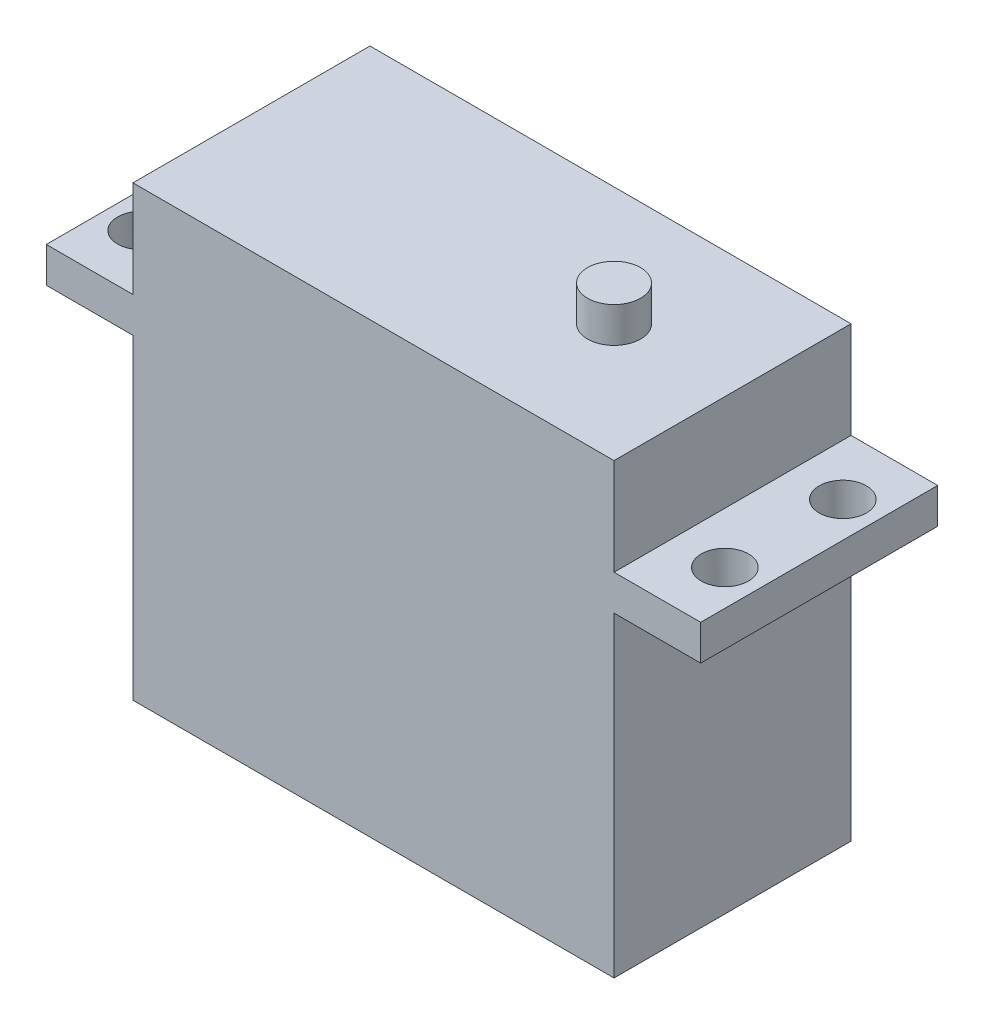
ISO-10303-21;
HEADER;
FILE_DESCRIPTION(('STEP AP214'),'2;1');
FILE_NAME('part.step','',(''),(''),'','','');
FILE_SCHEMA(('AUTOMOTIVE_DESIGN { 1 0 10303 214 1 1 1 1 }'));
ENDSEC;
DATA;
#1=APPLICATION_CONTEXT('core data for automotive mechanical design processes');
#2=APPLICATION_PROTOCOL_DEFINITION('international standard','automotive_design',2000,#1);
#3=PRODUCT_CONTEXT('',#1,'mechanical');
#4=PRODUCT('Part','Part','',(#3));
#5=PRODUCT_RELATED_PRODUCT_CATEGORY('part','',(#4));
#6=PRODUCT_DEFINITION_FORMATION('','',#4);
#7=PRODUCT_DEFINITION_CONTEXT('part definition',#1,'design');
#8=PRODUCT_DEFINITION('design','',#6,#7);
#9=PRODUCT_DEFINITION_SHAPE('','',#8);
#10=(LENGTH_UNIT() NAMED_UNIT(*) SI_UNIT(.MILLI.,.METRE.));
#11=(NAMED_UNIT(*) PLANE_ANGLE_UNIT() SI_UNIT($,.RADIAN.));
#12=(NAMED_UNIT(*) SI_UNIT($,.STERADIAN.) SOLID_ANGLE_UNIT());
#13=UNCERTAINTY_MEASURE_WITH_UNIT(LENGTH_MEASURE(1.E-05),#10,'distance_accuracy_value','');
#14=(GEOMETRIC_REPRESENTATION_CONTEXT(3) GLOBAL_UNCERTAINTY_ASSIGNED_CONTEXT((#13)) GLOBAL_UNIT_ASSIGNED_CONTEXT((#10,
#11,#12)) REPRESENTATION_CONTEXT('',''));
#15=CARTESIAN_POINT('',(0.,0.,0.));
#16=DIRECTION('',(0.,0.,1.));
#17=DIRECTION('',(1.,0.,0.));
#18=AXIS2_PLACEMENT_3D('',#15,#16,#17);
#19=CARTESIAN_POINT('',(0.,0.,20.1));
#20=DIRECTION('',(1.,0.,0.));
#21=DIRECTION('',(0.,0.,-1.));
#22=AXIS2_PLACEMENT_3D('',#19,#20,#21);
#23=PLANE('',#22);
#24=DIRECTION('',(0.,-1.,0.));
#25=VECTOR('',#24,1.);
#26=CARTESIAN_POINT('',(0.,0.,20.1));
#27=LINE('',#26,#25);
#28=CARTESIAN_POINT('',(0.,26.8,20.1));
#29=VERTEX_POINT('',#28);
#30=CARTESIAN_POINT('',(0.,0.,20.1));
#31=VERTEX_POINT('',#30);
#32=EDGE_CURVE('E169',#29,#31,#27,.T.);
#33=ORIENTED_EDGE('',*,*,#32,.F.);
#34=DIRECTION('',(0.,0.,-1.));
#35=VECTOR('',#34,1.);
#36=CARTESIAN_POINT('',(0.,26.8,20.1));
#37=LINE('',#36,#35);
#38=CARTESIAN_POINT('',(0.,26.8,0.));
#39=VERTEX_POINT('',#38);
#40=EDGE_CURVE('E161',#29,#39,#37,.T.);
#41=ORIENTED_EDGE('',*,*,#40,.T.);
#42=DIRECTION('',(0.,-1.,0.));
#43=VECTOR('',#42,1.);
#44=CARTESIAN_POINT('',(0.,0.,0.));
#45=LINE('',#44,#43);
#46=CARTESIAN_POINT('',(0.,0.,0.));
#47=VERTEX_POINT('',#46);
#48=EDGE_CURVE('E164',#39,#47,#45,.T.);
#49=ORIENTED_EDGE('',*,*,#48,.T.);
#50=DIRECTION('',(0.,0.,-1.));
#51=VECTOR('',#50,1.);
#52=CARTESIAN_POINT('',(0.,0.,20.1));
#53=LINE('',#52,#51);
#54=EDGE_CURVE('E44',#31,#47,#53,.T.);
#55=ORIENTED_EDGE('',*,*,#54,.F.);
#56=EDGE_LOOP('',(#33,#41,#49,#55));
#57=FACE_BOUND('',#56,.T.);
#58=ADVANCED_FACE('F36',(#57),#23,.F.);
#59=CARTESIAN_POINT('',(40.8,0.,20.1));
#60=DIRECTION('',(-1.,0.,0.));
#61=DIRECTION('',(0.,0.,1.));
#62=AXIS2_PLACEMENT_3D('',#59,#60,#61);
#63=PLANE('',#62);
#64=DIRECTION('',(0.,1.,0.));
#65=VECTOR('',#64,1.);
#66=CARTESIAN_POINT('',(40.8,0.,0.));
#67=LINE('',#66,#65);
#68=CARTESIAN_POINT('',(40.8,0.,0.));
#69=VERTEX_POINT('',#68);
#70=CARTESIAN_POINT('',(40.8,26.8,0.));
#71=VERTEX_POINT('',#70);
#72=EDGE_CURVE('E184',#69,#71,#67,.T.);
#73=ORIENTED_EDGE('',*,*,#72,.T.);
#74=DIRECTION('',(0.,0.,1.));
#75=VECTOR('',#74,1.);
#76=CARTESIAN_POINT('',(40.8,26.8,20.1));
#77=LINE('',#76,#75);
#78=CARTESIAN_POINT('',(40.8,26.8,20.1));
#79=VERTEX_POINT('',#78);
#80=EDGE_CURVE('E132',#71,#79,#77,.T.);
#81=ORIENTED_EDGE('',*,*,#80,.T.);
#82=DIRECTION('',(0.,1.,0.));
#83=VECTOR('',#82,1.);
#84=CARTESIAN_POINT('',(40.8,0.,20.1));
#85=LINE('',#84,#83);
#86=CARTESIAN_POINT('',(40.8,0.,20.1));
#87=VERTEX_POINT('',#86);
#88=EDGE_CURVE('E172',#87,#79,#85,.T.);
#89=ORIENTED_EDGE('',*,*,#88,.F.);
#90=DIRECTION('',(0.,0.,-1.));
#91=VECTOR('',#90,1.);
#92=CARTESIAN_POINT('',(40.8,0.,20.1));
#93=LINE('',#92,#91);
#94=EDGE_CURVE('E193',#87,#69,#93,.T.);
#95=ORIENTED_EDGE('',*,*,#94,.T.);
#96=EDGE_LOOP('',(#73,#81,#89,#95));
#97=FACE_BOUND('',#96,.T.);
#98=ADVANCED_FACE('F284',(#97),#63,.F.);
#99=CARTESIAN_POINT('',(0.,38.,0.));
#100=VERTEX_POINT('',#99);
#101=CARTESIAN_POINT('',(0.,29.8,0.));
#102=VERTEX_POINT('',#101);
#103=EDGE_CURVE('E178',#100,#102,#45,.T.);
#104=ORIENTED_EDGE('',*,*,#103,.T.);
#105=DIRECTION('',(0.,0.,1.));
#106=VECTOR('',#105,1.);
#107=CARTESIAN_POINT('',(0.,29.8,20.1));
#108=LINE('',#107,#106);
#109=CARTESIAN_POINT('',(0.,29.8,20.1));
#110=VERTEX_POINT('',#109);
#111=EDGE_CURVE('E158',#102,#110,#108,.T.);
#112=ORIENTED_EDGE('',*,*,#111,.T.);
#113=CARTESIAN_POINT('',(0.,38.,20.1));
#114=VERTEX_POINT('',#113);
#115=EDGE_CURVE('E165',#114,#110,#27,.T.);
#116=ORIENTED_EDGE('',*,*,#115,.F.);
#117=DIRECTION('',(0.,0.,-1.));
#118=VECTOR('',#117,1.);
#119=CARTESIAN_POINT('',(0.,38.,20.1));
#120=LINE('',#119,#118);
#121=EDGE_CURVE('E177',#114,#100,#120,.T.);
#122=ORIENTED_EDGE('',*,*,#121,.T.);
#123=EDGE_LOOP('',(#104,#112,#116,#122));
#124=FACE_BOUND('',#123,.T.);
#125=ADVANCED_FACE('F38',(#124),#23,.F.);
#126=CARTESIAN_POINT('',(0.,0.,20.1));
#127=DIRECTION('',(0.,1.,0.));
#128=DIRECTION('',(0.,0.,1.));
#129=AXIS2_PLACEMENT_3D('',#126,#127,#128);
#130=PLANE('',#129);
#131=DIRECTION('',(1.,0.,0.));
#132=VECTOR('',#131,1.);
#133=CARTESIAN_POINT('',(0.,0.,0.));
#134=LINE('',#133,#132);
#135=EDGE_CURVE('E181',#47,#69,#134,.T.);
#136=ORIENTED_EDGE('',*,*,#135,.T.);
#137=ORIENTED_EDGE('',*,*,#94,.F.);
#138=DIRECTION('',(1.,0.,0.));
#139=VECTOR('',#138,1.);
#140=CARTESIAN_POINT('',(0.,0.,20.1));
#141=LINE('',#140,#139);
#142=EDGE_CURVE('E168',#31,#87,#141,.T.);
#143=ORIENTED_EDGE('',*,*,#142,.F.);
#144=ORIENTED_EDGE('',*,*,#54,.T.);
#145=EDGE_LOOP('',(#136,#137,#143,#144));
#146=FACE_BOUND('',#145,.T.);
#147=ADVANCED_FACE('F282',(#146),#130,.F.);
#148=CARTESIAN_POINT('',(40.8,29.8,20.1));
#149=VERTEX_POINT('',#148);
#150=CARTESIAN_POINT('',(40.8,38.,20.1));
#151=VERTEX_POINT('',#150);
#152=EDGE_CURVE('E171',#149,#151,#85,.T.);
#153=ORIENTED_EDGE('',*,*,#152,.F.);
#154=DIRECTION('',(0.,0.,-1.));
#155=VECTOR('',#154,1.);
#156=CARTESIAN_POINT('',(40.8,29.8,20.1));
#157=LINE('',#156,#155);
#158=CARTESIAN_POINT('',(40.8,29.8,0.));
#159=VERTEX_POINT('',#158);
#160=EDGE_CURVE('E155',#149,#159,#157,.T.);
#161=ORIENTED_EDGE('',*,*,#160,.T.);
#162=CARTESIAN_POINT('',(40.8,38.,0.));
#163=VERTEX_POINT('',#162);
#164=EDGE_CURVE('E183',#159,#163,#67,.T.);
#165=ORIENTED_EDGE('',*,*,#164,.T.);
#166=DIRECTION('',(0.,0.,-1.));
#167=VECTOR('',#166,1.);
#168=CARTESIAN_POINT('',(40.8,38.,20.1));
#169=LINE('',#168,#167);
#170=EDGE_CURVE('E190',#151,#163,#169,.T.);
#171=ORIENTED_EDGE('',*,*,#170,.F.);
#172=EDGE_LOOP('',(#153,#161,#165,#171));
#173=FACE_BOUND('',#172,.T.);
#174=ADVANCED_FACE('F269',(#173),#63,.F.);
#175=CARTESIAN_POINT('',(0.,38.,20.1));
#176=DIRECTION('',(0.,-1.,0.));
#177=DIRECTION('',(0.,0.,-1.));
#178=AXIS2_PLACEMENT_3D('',#175,#176,#177);
#179=PLANE('',#178);
#180=CARTESIAN_POINT('',(30.75,38.,10.05));
#181=DIRECTION('',(0.,-1.,0.));
#182=DIRECTION('',(0.,0.,-1.));
#183=AXIS2_PLACEMENT_3D('',#180,#181,#182);
#184=CIRCLE('',#183,2.25);
#185=CARTESIAN_POINT('',(30.75,38.,7.8));
#186=VERTEX_POINT('',#185);
#187=EDGE_CURVE('E11',#186,#186,#184,.F.);
#188=ORIENTED_EDGE('',*,*,#187,.F.);
#189=EDGE_LOOP('',(#188));
#190=FACE_BOUND('',#189,.T.);
#191=DIRECTION('',(-1.,0.,0.));
#192=VECTOR('',#191,1.);
#193=CARTESIAN_POINT('',(0.,38.,0.));
#194=LINE('',#193,#192);
#195=EDGE_CURVE('E186',#163,#100,#194,.T.);
#196=ORIENTED_EDGE('',*,*,#195,.T.);
#197=ORIENTED_EDGE('',*,*,#121,.F.);
#198=DIRECTION('',(-1.,0.,0.));
#199=VECTOR('',#198,1.);
#200=CARTESIAN_POINT('',(0.,38.,20.1));
#201=LINE('',#200,#199);
#202=EDGE_CURVE('E175',#151,#114,#201,.T.);
#203=ORIENTED_EDGE('',*,*,#202,.F.);
#204=ORIENTED_EDGE('',*,*,#170,.T.);
#205=EDGE_LOOP('',(#196,#197,#203,#204));
#206=FACE_BOUND('',#205,.T.);
#207=ADVANCED_FACE('F265',(#190,#206),#179,.F.);
#208=CARTESIAN_POINT('',(0.,0.,20.1));
#209=DIRECTION('',(0.,0.,-1.));
#210=DIRECTION('',(-1.,0.,0.));
#211=AXIS2_PLACEMENT_3D('',#208,#209,#210);
#212=PLANE('',#211);
#213=ORIENTED_EDGE('',*,*,#115,.T.);
#214=DIRECTION('',(-1.,0.,0.));
#215=VECTOR('',#214,1.);
#216=CARTESIAN_POINT('',(-7.35,29.8,20.1));
#217=LINE('',#216,#215);
#218=CARTESIAN_POINT('',(-7.35,29.8,20.1));
#219=VERTEX_POINT('',#218);
#220=EDGE_CURVE('E51',#110,#219,#217,.T.);
#221=ORIENTED_EDGE('',*,*,#220,.T.);
#222=DIRECTION('',(0.,-1.,0.));
#223=VECTOR('',#222,1.);
#224=CARTESIAN_POINT('',(-7.35,29.8,20.1));
#225=LINE('',#224,#223);
#226=CARTESIAN_POINT('',(-7.35,26.8,20.1));
#227=VERTEX_POINT('',#226);
#228=EDGE_CURVE('E203',#219,#227,#225,.T.);
#229=ORIENTED_EDGE('',*,*,#228,.T.);
#230=DIRECTION('',(1.,0.,0.));
#231=VECTOR('',#230,1.);
#232=CARTESIAN_POINT('',(-7.35,26.8,20.1));
#233=LINE('',#232,#231);
#234=EDGE_CURVE('E212',#227,#29,#233,.T.);
#235=ORIENTED_EDGE('',*,*,#234,.T.);
#236=ORIENTED_EDGE('',*,*,#32,.T.);
#237=ORIENTED_EDGE('',*,*,#142,.T.);
#238=ORIENTED_EDGE('',*,*,#88,.T.);
#239=CARTESIAN_POINT('',(48.15,26.8,20.1));
#240=VERTEX_POINT('',#239);
#241=EDGE_CURVE('E207',#79,#240,#233,.T.);
#242=ORIENTED_EDGE('',*,*,#241,.T.);
#243=DIRECTION('',(0.,1.,0.));
#244=VECTOR('',#243,1.);
#245=CARTESIAN_POINT('',(48.15,29.8,20.1));
#246=LINE('',#245,#244);
#247=CARTESIAN_POINT('',(48.15,29.8,20.1));
#248=VERTEX_POINT('',#247);
#249=EDGE_CURVE('E148',#240,#248,#246,.T.);
#250=ORIENTED_EDGE('',*,*,#249,.T.);
#251=EDGE_CURVE('E137',#248,#149,#217,.T.);
#252=ORIENTED_EDGE('',*,*,#251,.T.);
#253=ORIENTED_EDGE('',*,*,#152,.T.);
#254=ORIENTED_EDGE('',*,*,#202,.T.);
#255=EDGE_LOOP('',(#213,#221,#229,#235,#236,#237,#238,#242,#250,#252,#253,#254));
#256=FACE_BOUND('',#255,.T.);
#257=ADVANCED_FACE('F268',(#256),#212,.F.);
#258=CARTESIAN_POINT('',(0.,0.,0.));
#259=DIRECTION('',(0.,0.,-1.));
#260=DIRECTION('',(-1.,0.,0.));
#261=AXIS2_PLACEMENT_3D('',#258,#259,#260);
#262=PLANE('',#261);
#263=ORIENTED_EDGE('',*,*,#164,.F.);
#264=DIRECTION('',(-1.,0.,0.));
#265=VECTOR('',#264,1.);
#266=CARTESIAN_POINT('',(-7.35,29.8,0.));
#267=LINE('',#266,#265);
#268=CARTESIAN_POINT('',(48.15,29.8,0.));
#269=VERTEX_POINT('',#268);
#270=EDGE_CURVE('E59',#269,#159,#267,.T.);
#271=ORIENTED_EDGE('',*,*,#270,.F.);
#272=DIRECTION('',(0.,1.,0.));
#273=VECTOR('',#272,1.);
#274=CARTESIAN_POINT('',(48.15,29.8,0.));
#275=LINE('',#274,#273);
#276=CARTESIAN_POINT('',(48.15,26.8,0.));
#277=VERTEX_POINT('',#276);
#278=EDGE_CURVE('E140',#277,#269,#275,.T.);
#279=ORIENTED_EDGE('',*,*,#278,.F.);
#280=DIRECTION('',(1.,0.,0.));
#281=VECTOR('',#280,1.);
#282=CARTESIAN_POINT('',(-7.35,26.8,0.));
#283=LINE('',#282,#281);
#284=EDGE_CURVE('E125',#71,#277,#283,.T.);
#285=ORIENTED_EDGE('',*,*,#284,.F.);
#286=ORIENTED_EDGE('',*,*,#72,.F.);
#287=ORIENTED_EDGE('',*,*,#135,.F.);
#288=ORIENTED_EDGE('',*,*,#48,.F.);
#289=CARTESIAN_POINT('',(-7.35,26.8,0.));
#290=VERTEX_POINT('',#289);
#291=EDGE_CURVE('E136',#290,#39,#283,.T.);
#292=ORIENTED_EDGE('',*,*,#291,.F.);
#293=DIRECTION('',(0.,-1.,0.));
#294=VECTOR('',#293,1.);
#295=CARTESIAN_POINT('',(-7.35,29.8,0.));
#296=LINE('',#295,#294);
#297=CARTESIAN_POINT('',(-7.35,29.8,0.));
#298=VERTEX_POINT('',#297);
#299=EDGE_CURVE('E156',#298,#290,#296,.T.);
#300=ORIENTED_EDGE('',*,*,#299,.F.);
#301=EDGE_CURVE('E219',#102,#298,#267,.T.);
#302=ORIENTED_EDGE('',*,*,#301,.F.);
#303=ORIENTED_EDGE('',*,*,#103,.F.);
#304=ORIENTED_EDGE('',*,*,#195,.F.);
#305=EDGE_LOOP('',(#263,#271,#279,#285,#286,#287,#288,#292,#300,#302,#303,#304));
#306=FACE_BOUND('',#305,.T.);
#307=ADVANCED_FACE('F142',(#306),#262,.T.);
#308=CARTESIAN_POINT('',(48.15,29.8,-55.5810219409467));
#309=DIRECTION('',(1.,0.,0.));
#310=DIRECTION('',(0.,0.,-1.));
#311=AXIS2_PLACEMENT_3D('',#308,#309,#310);
#312=PLANE('',#311);
#313=DIRECTION('',(0.,0.,1.));
#314=VECTOR('',#313,1.);
#315=CARTESIAN_POINT('',(48.15,26.8,-55.5810219409467));
#316=LINE('',#315,#314);
#317=EDGE_CURVE('E129',#277,#240,#316,.T.);
#318=ORIENTED_EDGE('',*,*,#317,.F.);
#319=ORIENTED_EDGE('',*,*,#278,.T.);
#320=DIRECTION('',(0.,0.,1.));
#321=VECTOR('',#320,1.);
#322=CARTESIAN_POINT('',(48.15,29.8,-55.5810219409467));
#323=LINE('',#322,#321);
#324=EDGE_CURVE('E144',#269,#248,#323,.T.);
#325=ORIENTED_EDGE('',*,*,#324,.T.);
#326=ORIENTED_EDGE('',*,*,#249,.F.);
#327=EDGE_LOOP('',(#318,#319,#325,#326));
#328=FACE_BOUND('',#327,.T.);
#329=ADVANCED_FACE('F146',(#328),#312,.T.);
#330=CARTESIAN_POINT('',(-7.35,29.8,-55.5810219409467));
#331=DIRECTION('',(0.,1.,0.));
#332=DIRECTION('',(-1.,0.,0.));
#333=AXIS2_PLACEMENT_3D('',#330,#331,#332);
#334=PLANE('',#333);
#335=CARTESIAN_POINT('',(45.15,29.8,5.05));
#336=DIRECTION('',(0.,1.,0.));
#337=DIRECTION('',(-1.,0.,0.));
#338=AXIS2_PLACEMENT_3D('',#335,#336,#337);
#339=CIRCLE('',#338,2.);
#340=CARTESIAN_POINT('',(43.15,29.8,5.05));
#341=VERTEX_POINT('',#340);
#342=EDGE_CURVE('E244',#341,#341,#339,.T.);
#343=ORIENTED_EDGE('',*,*,#342,.F.);
#344=EDGE_LOOP('',(#343));
#345=FACE_BOUND('',#344,.T.);
#346=CARTESIAN_POINT('',(45.15,29.8,15.05));
#347=DIRECTION('',(0.,1.,0.));
#348=DIRECTION('',(-1.,0.,0.));
#349=AXIS2_PLACEMENT_3D('',#346,#347,#348);
#350=CIRCLE('',#349,2.);
#351=CARTESIAN_POINT('',(43.15,29.8,15.05));
#352=VERTEX_POINT('',#351);
#353=EDGE_CURVE('E247',#352,#352,#350,.T.);
#354=ORIENTED_EDGE('',*,*,#353,.F.);
#355=EDGE_LOOP('',(#354));
#356=FACE_BOUND('',#355,.T.);
#357=ORIENTED_EDGE('',*,*,#160,.F.);
#358=ORIENTED_EDGE('',*,*,#251,.F.);
#359=ORIENTED_EDGE('',*,*,#324,.F.);
#360=ORIENTED_EDGE('',*,*,#270,.T.);
#361=EDGE_LOOP('',(#357,#358,#359,#360));
#362=FACE_BOUND('',#361,.T.);
#363=ADVANCED_FACE('F278',(#345,#356,#362),#334,.T.);
#364=CARTESIAN_POINT('',(-7.35,26.8,-55.5810219409467));
#365=DIRECTION('',(0.,-1.,0.));
#366=DIRECTION('',(1.,0.,0.));
#367=AXIS2_PLACEMENT_3D('',#364,#365,#366);
#368=PLANE('',#367);
#369=CARTESIAN_POINT('',(45.15,26.8,5.05));
#370=DIRECTION('',(0.,-1.,0.));
#371=DIRECTION('',(1.,0.,0.));
#372=AXIS2_PLACEMENT_3D('',#369,#370,#371);
#373=CIRCLE('',#372,2.);
#374=CARTESIAN_POINT('',(47.15,26.8,5.05));
#375=VERTEX_POINT('',#374);
#376=EDGE_CURVE('E200',#375,#375,#373,.T.);
#377=ORIENTED_EDGE('',*,*,#376,.F.);
#378=EDGE_LOOP('',(#377));
#379=FACE_BOUND('',#378,.T.);
#380=CARTESIAN_POINT('',(45.15,26.8,15.05));
#381=DIRECTION('',(0.,-1.,0.));
#382=DIRECTION('',(1.,0.,0.));
#383=AXIS2_PLACEMENT_3D('',#380,#381,#382);
#384=CIRCLE('',#383,2.);
#385=CARTESIAN_POINT('',(47.15,26.8,15.05));
#386=VERTEX_POINT('',#385);
#387=EDGE_CURVE('E198',#386,#386,#384,.T.);
#388=ORIENTED_EDGE('',*,*,#387,.F.);
#389=EDGE_LOOP('',(#388));
#390=FACE_BOUND('',#389,.T.);
#391=ORIENTED_EDGE('',*,*,#80,.F.);
#392=ORIENTED_EDGE('',*,*,#284,.T.);
#393=ORIENTED_EDGE('',*,*,#317,.T.);
#394=ORIENTED_EDGE('',*,*,#241,.F.);
#395=EDGE_LOOP('',(#391,#392,#393,#394));
#396=FACE_BOUND('',#395,.T.);
#397=ADVANCED_FACE('F127',(#379,#390,#396),#368,.T.);
#398=CARTESIAN_POINT('',(-4.35,26.8,15.05));
#399=DIRECTION('',(0.,-1.,0.));
#400=DIRECTION('',(1.,0.,0.));
#401=AXIS2_PLACEMENT_3D('',#398,#399,#400);
#402=CIRCLE('',#401,2.);
#403=CARTESIAN_POINT('',(-2.35,26.8,15.05));
#404=VERTEX_POINT('',#403);
#405=EDGE_CURVE('E201',#404,#404,#402,.T.);
#406=ORIENTED_EDGE('',*,*,#405,.F.);
#407=EDGE_LOOP('',(#406));
#408=FACE_BOUND('',#407,.T.);
#409=CARTESIAN_POINT('',(-4.35,26.8,5.05));
#410=DIRECTION('',(0.,-1.,0.));
#411=DIRECTION('',(1.,0.,0.));
#412=AXIS2_PLACEMENT_3D('',#409,#410,#411);
#413=CIRCLE('',#412,2.);
#414=CARTESIAN_POINT('',(-2.35,26.8,5.05));
#415=VERTEX_POINT('',#414);
#416=EDGE_CURVE('E237',#415,#415,#413,.T.);
#417=ORIENTED_EDGE('',*,*,#416,.F.);
#418=EDGE_LOOP('',(#417));
#419=FACE_BOUND('',#418,.T.);
#420=ORIENTED_EDGE('',*,*,#40,.F.);
#421=ORIENTED_EDGE('',*,*,#234,.F.);
#422=DIRECTION('',(0.,0.,1.));
#423=VECTOR('',#422,1.);
#424=CARTESIAN_POINT('',(-7.35,26.8,-55.5810219409467));
#425=LINE('',#424,#423);
#426=EDGE_CURVE('E153',#290,#227,#425,.T.);
#427=ORIENTED_EDGE('',*,*,#426,.F.);
#428=ORIENTED_EDGE('',*,*,#291,.T.);
#429=EDGE_LOOP('',(#420,#421,#427,#428));
#430=FACE_BOUND('',#429,.T.);
#431=ADVANCED_FACE('F229',(#408,#419,#430),#368,.T.);
#432=CARTESIAN_POINT('',(-4.35,29.8,15.05));
#433=DIRECTION('',(0.,1.,0.));
#434=DIRECTION('',(-1.,0.,0.));
#435=AXIS2_PLACEMENT_3D('',#432,#433,#434);
#436=CIRCLE('',#435,2.);
#437=CARTESIAN_POINT('',(-6.35,29.8,15.05));
#438=VERTEX_POINT('',#437);
#439=EDGE_CURVE('E243',#438,#438,#436,.T.);
#440=ORIENTED_EDGE('',*,*,#439,.F.);
#441=EDGE_LOOP('',(#440));
#442=FACE_BOUND('',#441,.T.);
#443=CARTESIAN_POINT('',(-4.35,29.8,5.05));
#444=DIRECTION('',(0.,1.,0.));
#445=DIRECTION('',(-1.,0.,0.));
#446=AXIS2_PLACEMENT_3D('',#443,#444,#445);
#447=CIRCLE('',#446,2.);
#448=CARTESIAN_POINT('',(-6.35,29.8,5.05));
#449=VERTEX_POINT('',#448);
#450=EDGE_CURVE('E240',#449,#449,#447,.T.);
#451=ORIENTED_EDGE('',*,*,#450,.F.);
#452=EDGE_LOOP('',(#451));
#453=FACE_BOUND('',#452,.T.);
#454=ORIENTED_EDGE('',*,*,#111,.F.);
#455=ORIENTED_EDGE('',*,*,#301,.T.);
#456=DIRECTION('',(0.,0.,1.));
#457=VECTOR('',#456,1.);
#458=CARTESIAN_POINT('',(-7.35,29.8,-55.5810219409467));
#459=LINE('',#458,#457);
#460=EDGE_CURVE('E218',#298,#219,#459,.T.);
#461=ORIENTED_EDGE('',*,*,#460,.T.);
#462=ORIENTED_EDGE('',*,*,#220,.F.);
#463=EDGE_LOOP('',(#454,#455,#461,#462));
#464=FACE_BOUND('',#463,.T.);
#465=ADVANCED_FACE('F221',(#442,#453,#464),#334,.T.);
#466=CARTESIAN_POINT('',(-7.35,29.8,-55.5810219409467));
#467=DIRECTION('',(-1.,0.,0.));
#468=DIRECTION('',(0.,0.,1.));
#469=AXIS2_PLACEMENT_3D('',#466,#467,#468);
#470=PLANE('',#469);
#471=ORIENTED_EDGE('',*,*,#460,.F.);
#472=ORIENTED_EDGE('',*,*,#299,.T.);
#473=ORIENTED_EDGE('',*,*,#426,.T.);
#474=ORIENTED_EDGE('',*,*,#228,.F.);
#475=EDGE_LOOP('',(#471,#472,#473,#474));
#476=FACE_BOUND('',#475,.T.);
#477=ADVANCED_FACE('F225',(#476),#470,.T.);
#478=CARTESIAN_POINT('',(-4.35,0.,5.05));
#479=DIRECTION('',(0.,1.,0.));
#480=DIRECTION('',(-1.,0.,0.));
#481=AXIS2_PLACEMENT_3D('',#478,#479,#480);
#482=CYLINDRICAL_SURFACE('',#481,2.);
#483=ORIENTED_EDGE('',*,*,#416,.T.);
#484=EDGE_LOOP('',(#483));
#485=FACE_BOUND('',#484,.T.);
#486=ORIENTED_EDGE('',*,*,#450,.T.);
#487=EDGE_LOOP('',(#486));
#488=FACE_BOUND('',#487,.T.);
#489=ADVANCED_FACE('F364',(#485,#488),#482,.F.);
#490=CARTESIAN_POINT('',(-4.35,0.,15.05));
#491=DIRECTION('',(0.,1.,0.));
#492=DIRECTION('',(-1.,0.,0.));
#493=AXIS2_PLACEMENT_3D('',#490,#491,#492);
#494=CYLINDRICAL_SURFACE('',#493,2.);
#495=ORIENTED_EDGE('',*,*,#405,.T.);
#496=EDGE_LOOP('',(#495));
#497=FACE_BOUND('',#496,.T.);
#498=ORIENTED_EDGE('',*,*,#439,.T.);
#499=EDGE_LOOP('',(#498));
#500=FACE_BOUND('',#499,.T.);
#501=ADVANCED_FACE('F405',(#497,#500),#494,.F.);
#502=CARTESIAN_POINT('',(45.15,0.,15.05));
#503=DIRECTION('',(0.,1.,0.));
#504=DIRECTION('',(-1.,0.,0.));
#505=AXIS2_PLACEMENT_3D('',#502,#503,#504);
#506=CYLINDRICAL_SURFACE('',#505,2.);
#507=ORIENTED_EDGE('',*,*,#387,.T.);
#508=EDGE_LOOP('',(#507));
#509=FACE_BOUND('',#508,.T.);
#510=ORIENTED_EDGE('',*,*,#353,.T.);
#511=EDGE_LOOP('',(#510));
#512=FACE_BOUND('',#511,.T.);
#513=ADVANCED_FACE('F415',(#509,#512),#506,.F.);
#514=CARTESIAN_POINT('',(45.15,0.,5.05));
#515=DIRECTION('',(0.,1.,0.));
#516=DIRECTION('',(-1.,0.,0.));
#517=AXIS2_PLACEMENT_3D('',#514,#515,#516);
#518=CYLINDRICAL_SURFACE('',#517,2.);
#519=ORIENTED_EDGE('',*,*,#376,.T.);
#520=EDGE_LOOP('',(#519));
#521=FACE_BOUND('',#520,.T.);
#522=ORIENTED_EDGE('',*,*,#342,.T.);
#523=EDGE_LOOP('',(#522));
#524=FACE_BOUND('',#523,.T.);
#525=ADVANCED_FACE('F261',(#521,#524),#518,.F.);
#526=CARTESIAN_POINT('',(30.75,41.,10.05));
#527=DIRECTION('',(0.,-1.,0.));
#528=DIRECTION('',(0.,0.,-1.));
#529=AXIS2_PLACEMENT_3D('',#526,#527,#528);
#530=CYLINDRICAL_SURFACE('',#529,2.25);
#531=CARTESIAN_POINT('',(30.75,41.,10.05));
#532=DIRECTION('',(0.,1.,0.));
#533=DIRECTION('',(0.,0.,1.));
#534=AXIS2_PLACEMENT_3D('',#531,#532,#533);
#535=CIRCLE('',#534,2.25);
#536=CARTESIAN_POINT('',(30.75,41.,12.3));
#537=VERTEX_POINT('',#536);
#538=EDGE_CURVE('E248',#537,#537,#535,.T.);
#539=ORIENTED_EDGE('',*,*,#538,.F.);
#540=EDGE_LOOP('',(#539));
#541=FACE_BOUND('',#540,.T.);
#542=ORIENTED_EDGE('',*,*,#187,.T.);
#543=EDGE_LOOP('',(#542));
#544=FACE_BOUND('',#543,.T.);
#545=ADVANCED_FACE('F258',(#541,#544),#530,.T.);
#546=CARTESIAN_POINT('',(30.75,41.,10.05));
#547=DIRECTION('',(0.,1.,0.));
#548=DIRECTION('',(0.,0.,1.));
#549=AXIS2_PLACEMENT_3D('',#546,#547,#548);
#550=PLANE('',#549);
#551=ORIENTED_EDGE('',*,*,#538,.T.);
#552=EDGE_LOOP('',(#551));
#553=FACE_BOUND('',#552,.T.);
#554=ADVANCED_FACE('F256',(#553),#550,.T.);
#555=CLOSED_SHELL('',(#58,#98,#125,#147,#174,#207,#257,#307,#329,#363,#397,#431,#465,#477,#489,
#501,#513,#525,#545,#554));
#556=MANIFOLD_SOLID_BREP('B2',#555);
#557=ADVANCED_BREP_SHAPE_REPRESENTATION('',(#18,#556),#14);
#558=SHAPE_DEFINITION_REPRESENTATION(#9,#557);
ENDSEC;
END-ISO-10303-21;
